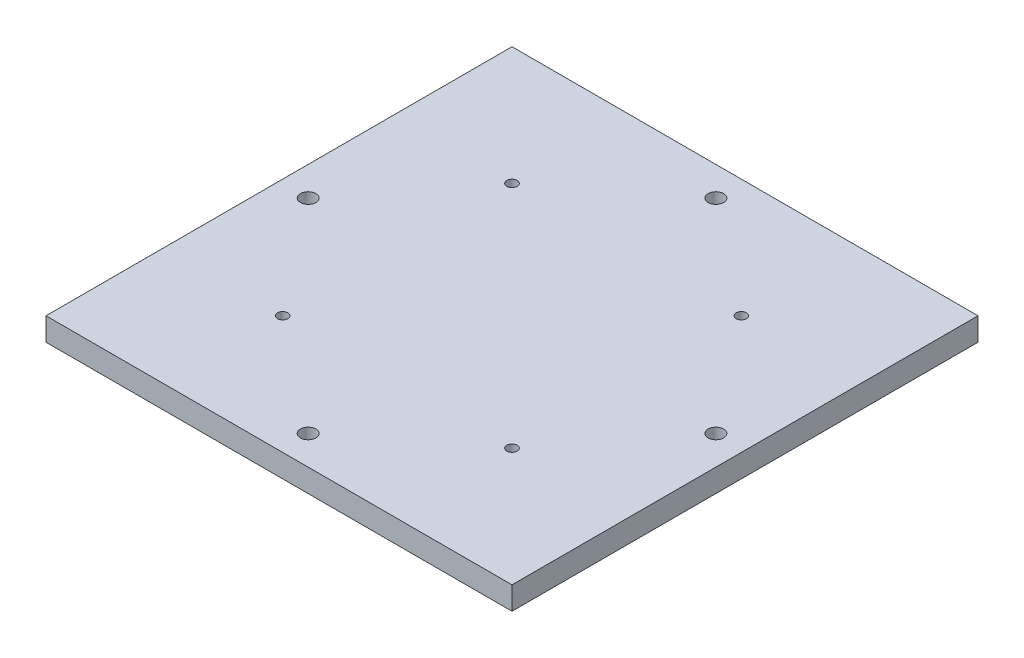
ISO-10303-21;
HEADER;
FILE_DESCRIPTION(('STEP AP214'),'2;1');
FILE_NAME('part.step','',(''),(''),'','','');
FILE_SCHEMA(('AUTOMOTIVE_DESIGN { 1 0 10303 214 1 1 1 1 }'));
ENDSEC;
DATA;
#1=APPLICATION_CONTEXT('core data for automotive mechanical design processes');
#2=APPLICATION_PROTOCOL_DEFINITION('international standard','automotive_design',2000,#1);
#3=PRODUCT_CONTEXT('',#1,'mechanical');
#4=PRODUCT('Part','Part','',(#3));
#5=PRODUCT_RELATED_PRODUCT_CATEGORY('part','',(#4));
#6=PRODUCT_DEFINITION_FORMATION('','',#4);
#7=PRODUCT_DEFINITION_CONTEXT('part definition',#1,'design');
#8=PRODUCT_DEFINITION('design','',#6,#7);
#9=PRODUCT_DEFINITION_SHAPE('','',#8);
#10=(LENGTH_UNIT() NAMED_UNIT(*) SI_UNIT(.MILLI.,.METRE.));
#11=(NAMED_UNIT(*) PLANE_ANGLE_UNIT() SI_UNIT($,.RADIAN.));
#12=(NAMED_UNIT(*) SI_UNIT($,.STERADIAN.) SOLID_ANGLE_UNIT());
#13=UNCERTAINTY_MEASURE_WITH_UNIT(LENGTH_MEASURE(1.E-05),#10,'distance_accuracy_value','');
#14=(GEOMETRIC_REPRESENTATION_CONTEXT(3) GLOBAL_UNCERTAINTY_ASSIGNED_CONTEXT((#13)) GLOBAL_UNIT_ASSIGNED_CONTEXT((#10,
#11,#12)) REPRESENTATION_CONTEXT('',''));
#15=CARTESIAN_POINT('',(0.,0.,0.));
#16=DIRECTION('',(0.,0.,1.));
#17=DIRECTION('',(1.,0.,0.));
#18=AXIS2_PLACEMENT_3D('',#15,#16,#17);
#19=CARTESIAN_POINT('',(0.,10.,0.));
#20=DIRECTION('',(0.,0.,-1.));
#21=DIRECTION('',(-1.,0.,0.));
#22=AXIS2_PLACEMENT_3D('',#19,#20,#21);
#23=PLANE('',#22);
#24=DIRECTION('',(1.,0.,0.));
#25=VECTOR('',#24,1.);
#26=CARTESIAN_POINT('',(0.,0.,0.));
#27=LINE('',#26,#25);
#28=CARTESIAN_POINT('',(0.,0.,0.));
#29=VERTEX_POINT('',#28);
#30=CARTESIAN_POINT('',(203.2,0.,0.));
#31=VERTEX_POINT('',#30);
#32=EDGE_CURVE('E132',#29,#31,#27,.T.);
#33=ORIENTED_EDGE('',*,*,#32,.T.);
#34=DIRECTION('',(0.,-1.,0.));
#35=VECTOR('',#34,1.);
#36=CARTESIAN_POINT('',(203.2,10.,0.));
#37=LINE('',#36,#35);
#38=CARTESIAN_POINT('',(203.2,10.,0.));
#39=VERTEX_POINT('',#38);
#40=EDGE_CURVE('E11',#39,#31,#37,.T.);
#41=ORIENTED_EDGE('',*,*,#40,.F.);
#42=DIRECTION('',(1.,0.,0.));
#43=VECTOR('',#42,1.);
#44=CARTESIAN_POINT('',(0.,10.,0.));
#45=LINE('',#44,#43);
#46=CARTESIAN_POINT('',(0.,10.,0.));
#47=VERTEX_POINT('',#46);
#48=EDGE_CURVE('E98',#47,#39,#45,.T.);
#49=ORIENTED_EDGE('',*,*,#48,.F.);
#50=DIRECTION('',(0.,-1.,0.));
#51=VECTOR('',#50,1.);
#52=CARTESIAN_POINT('',(0.,10.,0.));
#53=LINE('',#52,#51);
#54=EDGE_CURVE('E64',#47,#29,#53,.T.);
#55=ORIENTED_EDGE('',*,*,#54,.T.);
#56=EDGE_LOOP('',(#33,#41,#49,#55));
#57=FACE_BOUND('',#56,.T.);
#58=ADVANCED_FACE('F47',(#57),#23,.F.);
#59=CARTESIAN_POINT('',(203.2,10.,0.));
#60=DIRECTION('',(-1.,0.,0.));
#61=DIRECTION('',(0.,0.,1.));
#62=AXIS2_PLACEMENT_3D('',#59,#60,#61);
#63=PLANE('',#62);
#64=DIRECTION('',(0.,0.,-1.));
#65=VECTOR('',#64,1.);
#66=CARTESIAN_POINT('',(203.2,0.,0.));
#67=LINE('',#66,#65);
#68=CARTESIAN_POINT('',(203.2,0.,-203.2));
#69=VERTEX_POINT('',#68);
#70=EDGE_CURVE('E104',#31,#69,#67,.T.);
#71=ORIENTED_EDGE('',*,*,#70,.T.);
#72=DIRECTION('',(0.,-1.,0.));
#73=VECTOR('',#72,1.);
#74=CARTESIAN_POINT('',(203.2,10.,-203.2));
#75=LINE('',#74,#73);
#76=CARTESIAN_POINT('',(203.2,10.,-203.2));
#77=VERTEX_POINT('',#76);
#78=EDGE_CURVE('E56',#77,#69,#75,.T.);
#79=ORIENTED_EDGE('',*,*,#78,.F.);
#80=DIRECTION('',(0.,0.,-1.));
#81=VECTOR('',#80,1.);
#82=CARTESIAN_POINT('',(203.2,10.,0.));
#83=LINE('',#82,#81);
#84=EDGE_CURVE('E89',#39,#77,#83,.T.);
#85=ORIENTED_EDGE('',*,*,#84,.F.);
#86=ORIENTED_EDGE('',*,*,#40,.T.);
#87=EDGE_LOOP('',(#71,#79,#85,#86));
#88=FACE_BOUND('',#87,.T.);
#89=ADVANCED_FACE('F103',(#88),#63,.F.);
#90=CARTESIAN_POINT('',(0.,10.,-203.2));
#91=DIRECTION('',(0.,0.,-1.));
#92=DIRECTION('',(-1.,0.,0.));
#93=AXIS2_PLACEMENT_3D('',#90,#91,#92);
#94=PLANE('',#93);
#95=DIRECTION('',(1.,0.,0.));
#96=VECTOR('',#95,1.);
#97=CARTESIAN_POINT('',(0.,0.,-203.2));
#98=LINE('',#97,#96);
#99=CARTESIAN_POINT('',(0.,0.,-203.2));
#100=VERTEX_POINT('',#99);
#101=EDGE_CURVE('E138',#100,#69,#98,.T.);
#102=ORIENTED_EDGE('',*,*,#101,.F.);
#103=DIRECTION('',(0.,-1.,0.));
#104=VECTOR('',#103,1.);
#105=CARTESIAN_POINT('',(0.,10.,-203.2));
#106=LINE('',#105,#104);
#107=CARTESIAN_POINT('',(0.,10.,-203.2));
#108=VERTEX_POINT('',#107);
#109=EDGE_CURVE('E78',#108,#100,#106,.T.);
#110=ORIENTED_EDGE('',*,*,#109,.F.);
#111=DIRECTION('',(1.,0.,0.));
#112=VECTOR('',#111,1.);
#113=CARTESIAN_POINT('',(0.,10.,-203.2));
#114=LINE('',#113,#112);
#115=EDGE_CURVE('E97',#108,#77,#114,.T.);
#116=ORIENTED_EDGE('',*,*,#115,.T.);
#117=ORIENTED_EDGE('',*,*,#78,.T.);
#118=EDGE_LOOP('',(#102,#110,#116,#117));
#119=FACE_BOUND('',#118,.T.);
#120=ADVANCED_FACE('F108',(#119),#94,.T.);
#121=CARTESIAN_POINT('',(151.6,10.,-51.6));
#122=DIRECTION('',(0.,-1.,0.));
#123=DIRECTION('',(0.,0.,-1.));
#124=AXIS2_PLACEMENT_3D('',#121,#122,#123);
#125=CYLINDRICAL_SURFACE('',#124,2.25000000000001);
#126=CARTESIAN_POINT('',(151.6,10.,-51.6));
#127=DIRECTION('',(0.,1.,0.));
#128=DIRECTION('',(0.,0.,1.));
#129=AXIS2_PLACEMENT_3D('',#126,#127,#128);
#130=CIRCLE('',#129,2.25000000000001);
#131=CARTESIAN_POINT('',(151.6,10.,-49.35));
#132=VERTEX_POINT('',#131);
#133=EDGE_CURVE('E124',#132,#132,#130,.T.);
#134=ORIENTED_EDGE('',*,*,#133,.T.);
#135=EDGE_LOOP('',(#134));
#136=FACE_BOUND('',#135,.T.);
#137=CARTESIAN_POINT('',(151.6,0.,-51.6));
#138=DIRECTION('',(0.,1.,0.));
#139=DIRECTION('',(0.,0.,1.));
#140=AXIS2_PLACEMENT_3D('',#137,#138,#139);
#141=CIRCLE('',#140,2.25000000000001);
#142=CARTESIAN_POINT('',(151.6,0.,-49.35));
#143=VERTEX_POINT('',#142);
#144=EDGE_CURVE('E153',#143,#143,#141,.T.);
#145=ORIENTED_EDGE('',*,*,#144,.F.);
#146=EDGE_LOOP('',(#145));
#147=FACE_BOUND('',#146,.T.);
#148=ADVANCED_FACE('F255',(#136,#147),#125,.F.);
#149=CARTESIAN_POINT('',(151.6,10.,-151.6));
#150=DIRECTION('',(0.,-1.,0.));
#151=DIRECTION('',(0.,0.,-1.));
#152=AXIS2_PLACEMENT_3D('',#149,#150,#151);
#153=CYLINDRICAL_SURFACE('',#152,2.25000000000001);
#154=CARTESIAN_POINT('',(151.6,10.,-151.6));
#155=DIRECTION('',(0.,1.,0.));
#156=DIRECTION('',(0.,0.,1.));
#157=AXIS2_PLACEMENT_3D('',#154,#155,#156);
#158=CIRCLE('',#157,2.25000000000001);
#159=CARTESIAN_POINT('',(151.6,10.,-149.35));
#160=VERTEX_POINT('',#159);
#161=EDGE_CURVE('E120',#160,#160,#158,.T.);
#162=ORIENTED_EDGE('',*,*,#161,.T.);
#163=EDGE_LOOP('',(#162));
#164=FACE_BOUND('',#163,.T.);
#165=CARTESIAN_POINT('',(151.6,0.,-151.6));
#166=DIRECTION('',(0.,1.,0.));
#167=DIRECTION('',(0.,0.,1.));
#168=AXIS2_PLACEMENT_3D('',#165,#166,#167);
#169=CIRCLE('',#168,2.25000000000001);
#170=CARTESIAN_POINT('',(151.6,0.,-149.35));
#171=VERTEX_POINT('',#170);
#172=EDGE_CURVE('E149',#171,#171,#169,.T.);
#173=ORIENTED_EDGE('',*,*,#172,.F.);
#174=EDGE_LOOP('',(#173));
#175=FACE_BOUND('',#174,.T.);
#176=ADVANCED_FACE('F249',(#164,#175),#153,.F.);
#177=CARTESIAN_POINT('',(51.6,10.,-151.6));
#178=DIRECTION('',(0.,-1.,0.));
#179=DIRECTION('',(0.,0.,-1.));
#180=AXIS2_PLACEMENT_3D('',#177,#178,#179);
#181=CYLINDRICAL_SURFACE('',#180,2.25);
#182=CARTESIAN_POINT('',(51.6,10.,-151.6));
#183=DIRECTION('',(0.,1.,0.));
#184=DIRECTION('',(0.,0.,1.));
#185=AXIS2_PLACEMENT_3D('',#182,#183,#184);
#186=CIRCLE('',#185,2.25);
#187=CARTESIAN_POINT('',(51.6,10.,-149.35));
#188=VERTEX_POINT('',#187);
#189=EDGE_CURVE('E113',#188,#188,#186,.T.);
#190=ORIENTED_EDGE('',*,*,#189,.T.);
#191=EDGE_LOOP('',(#190));
#192=FACE_BOUND('',#191,.T.);
#193=CARTESIAN_POINT('',(51.6,0.,-151.6));
#194=DIRECTION('',(0.,1.,0.));
#195=DIRECTION('',(0.,0.,1.));
#196=AXIS2_PLACEMENT_3D('',#193,#194,#195);
#197=CIRCLE('',#196,2.25);
#198=CARTESIAN_POINT('',(51.6,0.,-149.35));
#199=VERTEX_POINT('',#198);
#200=EDGE_CURVE('E145',#199,#199,#197,.T.);
#201=ORIENTED_EDGE('',*,*,#200,.F.);
#202=EDGE_LOOP('',(#201));
#203=FACE_BOUND('',#202,.T.);
#204=ADVANCED_FACE('F241',(#192,#203),#181,.F.);
#205=CARTESIAN_POINT('',(0.,10.,0.));
#206=DIRECTION('',(-1.,0.,0.));
#207=DIRECTION('',(0.,0.,1.));
#208=AXIS2_PLACEMENT_3D('',#205,#206,#207);
#209=PLANE('',#208);
#210=DIRECTION('',(0.,0.,-1.));
#211=VECTOR('',#210,1.);
#212=CARTESIAN_POINT('',(0.,0.,0.));
#213=LINE('',#212,#211);
#214=EDGE_CURVE('E141',#29,#100,#213,.T.);
#215=ORIENTED_EDGE('',*,*,#214,.F.);
#216=ORIENTED_EDGE('',*,*,#54,.F.);
#217=DIRECTION('',(0.,0.,-1.));
#218=VECTOR('',#217,1.);
#219=CARTESIAN_POINT('',(0.,10.,0.));
#220=LINE('',#219,#218);
#221=EDGE_CURVE('E110',#47,#108,#220,.T.);
#222=ORIENTED_EDGE('',*,*,#221,.T.);
#223=ORIENTED_EDGE('',*,*,#109,.T.);
#224=EDGE_LOOP('',(#215,#216,#222,#223));
#225=FACE_BOUND('',#224,.T.);
#226=ADVANCED_FACE('F239',(#225),#209,.T.);
#227=CARTESIAN_POINT('',(51.6,10.,-51.6));
#228=DIRECTION('',(0.,-1.,0.));
#229=DIRECTION('',(0.,0.,-1.));
#230=AXIS2_PLACEMENT_3D('',#227,#228,#229);
#231=CYLINDRICAL_SURFACE('',#230,2.25);
#232=CARTESIAN_POINT('',(51.6,10.,-51.6));
#233=DIRECTION('',(0.,1.,0.));
#234=DIRECTION('',(0.,0.,1.));
#235=AXIS2_PLACEMENT_3D('',#232,#233,#234);
#236=CIRCLE('',#235,2.25);
#237=CARTESIAN_POINT('',(51.6,10.,-49.35));
#238=VERTEX_POINT('',#237);
#239=EDGE_CURVE('E128',#238,#238,#236,.T.);
#240=ORIENTED_EDGE('',*,*,#239,.T.);
#241=EDGE_LOOP('',(#240));
#242=FACE_BOUND('',#241,.T.);
#243=CARTESIAN_POINT('',(51.6,0.,-51.6));
#244=DIRECTION('',(0.,1.,0.));
#245=DIRECTION('',(0.,0.,1.));
#246=AXIS2_PLACEMENT_3D('',#243,#244,#245);
#247=CIRCLE('',#246,2.25);
#248=CARTESIAN_POINT('',(51.6,0.,-49.35));
#249=VERTEX_POINT('',#248);
#250=EDGE_CURVE('E157',#249,#249,#247,.T.);
#251=ORIENTED_EDGE('',*,*,#250,.F.);
#252=EDGE_LOOP('',(#251));
#253=FACE_BOUND('',#252,.T.);
#254=ADVANCED_FACE('F212',(#242,#253),#231,.F.);
#255=CARTESIAN_POINT('',(0.,10.,0.));
#256=DIRECTION('',(0.,1.,0.));
#257=DIRECTION('',(0.,0.,1.));
#258=AXIS2_PLACEMENT_3D('',#255,#256,#257);
#259=PLANE('',#258);
#260=CARTESIAN_POINT('',(101.6,10.,-12.7));
#261=DIRECTION('',(0.,1.,0.));
#262=DIRECTION('',(0.,0.,1.));
#263=AXIS2_PLACEMENT_3D('',#260,#261,#262);
#264=CIRCLE('',#263,3.37999999999999);
#265=CARTESIAN_POINT('',(101.6,10.,-9.32));
#266=VERTEX_POINT('',#265);
#267=EDGE_CURVE('E192',#266,#266,#264,.T.);
#268=ORIENTED_EDGE('',*,*,#267,.F.);
#269=EDGE_LOOP('',(#268));
#270=FACE_BOUND('',#269,.T.);
#271=CARTESIAN_POINT('',(12.7,10.,-101.6));
#272=DIRECTION('',(0.,1.,0.));
#273=DIRECTION('',(0.,0.,1.));
#274=AXIS2_PLACEMENT_3D('',#271,#272,#273);
#275=CIRCLE('',#274,3.38);
#276=CARTESIAN_POINT('',(12.7,10.,-98.22));
#277=VERTEX_POINT('',#276);
#278=EDGE_CURVE('E188',#277,#277,#275,.T.);
#279=ORIENTED_EDGE('',*,*,#278,.F.);
#280=EDGE_LOOP('',(#279));
#281=FACE_BOUND('',#280,.T.);
#282=CARTESIAN_POINT('',(101.6,10.,-190.5));
#283=DIRECTION('',(0.,1.,0.));
#284=DIRECTION('',(0.,0.,1.));
#285=AXIS2_PLACEMENT_3D('',#282,#283,#284);
#286=CIRCLE('',#285,3.38);
#287=CARTESIAN_POINT('',(101.6,10.,-187.12));
#288=VERTEX_POINT('',#287);
#289=EDGE_CURVE('E180',#288,#288,#286,.T.);
#290=ORIENTED_EDGE('',*,*,#289,.F.);
#291=EDGE_LOOP('',(#290));
#292=FACE_BOUND('',#291,.T.);
#293=CARTESIAN_POINT('',(190.5,10.,-101.6));
#294=DIRECTION('',(0.,1.,0.));
#295=DIRECTION('',(0.,0.,1.));
#296=AXIS2_PLACEMENT_3D('',#293,#294,#295);
#297=CIRCLE('',#296,3.38);
#298=CARTESIAN_POINT('',(190.5,10.,-98.22));
#299=VERTEX_POINT('',#298);
#300=EDGE_CURVE('E172',#299,#299,#297,.T.);
#301=ORIENTED_EDGE('',*,*,#300,.F.);
#302=EDGE_LOOP('',(#301));
#303=FACE_BOUND('',#302,.T.);
#304=ORIENTED_EDGE('',*,*,#48,.T.);
#305=ORIENTED_EDGE('',*,*,#84,.T.);
#306=ORIENTED_EDGE('',*,*,#115,.F.);
#307=ORIENTED_EDGE('',*,*,#221,.F.);
#308=EDGE_LOOP('',(#304,#305,#306,#307));
#309=FACE_BOUND('',#308,.T.);
#310=ORIENTED_EDGE('',*,*,#189,.F.);
#311=EDGE_LOOP('',(#310));
#312=FACE_BOUND('',#311,.T.);
#313=ORIENTED_EDGE('',*,*,#161,.F.);
#314=EDGE_LOOP('',(#313));
#315=FACE_BOUND('',#314,.T.);
#316=ORIENTED_EDGE('',*,*,#133,.F.);
#317=EDGE_LOOP('',(#316));
#318=FACE_BOUND('',#317,.T.);
#319=ORIENTED_EDGE('',*,*,#239,.F.);
#320=EDGE_LOOP('',(#319));
#321=FACE_BOUND('',#320,.T.);
#322=ADVANCED_FACE('F93',(#270,#281,#292,#303,#309,#312,#315,#318,#321),#259,.T.);
#323=CARTESIAN_POINT('',(0.,0.,0.));
#324=DIRECTION('',(0.,1.,0.));
#325=DIRECTION('',(0.,0.,1.));
#326=AXIS2_PLACEMENT_3D('',#323,#324,#325);
#327=PLANE('',#326);
#328=CARTESIAN_POINT('',(101.6,0.,-12.7));
#329=DIRECTION('',(0.,1.,0.));
#330=DIRECTION('',(0.,0.,1.));
#331=AXIS2_PLACEMENT_3D('',#328,#329,#330);
#332=CIRCLE('',#331,3.37999999999999);
#333=CARTESIAN_POINT('',(101.6,0.,-9.32));
#334=VERTEX_POINT('',#333);
#335=EDGE_CURVE('E135',#334,#334,#332,.T.);
#336=ORIENTED_EDGE('',*,*,#335,.T.);
#337=EDGE_LOOP('',(#336));
#338=FACE_BOUND('',#337,.T.);
#339=CARTESIAN_POINT('',(12.7,0.,-101.6));
#340=DIRECTION('',(0.,1.,0.));
#341=DIRECTION('',(0.,0.,1.));
#342=AXIS2_PLACEMENT_3D('',#339,#340,#341);
#343=CIRCLE('',#342,3.38);
#344=CARTESIAN_POINT('',(12.7,0.,-98.22));
#345=VERTEX_POINT('',#344);
#346=EDGE_CURVE('E184',#345,#345,#343,.T.);
#347=ORIENTED_EDGE('',*,*,#346,.T.);
#348=EDGE_LOOP('',(#347));
#349=FACE_BOUND('',#348,.T.);
#350=CARTESIAN_POINT('',(101.6,0.,-190.5));
#351=DIRECTION('',(0.,1.,0.));
#352=DIRECTION('',(0.,0.,1.));
#353=AXIS2_PLACEMENT_3D('',#350,#351,#352);
#354=CIRCLE('',#353,3.38);
#355=CARTESIAN_POINT('',(101.6,0.,-187.12));
#356=VERTEX_POINT('',#355);
#357=EDGE_CURVE('E176',#356,#356,#354,.T.);
#358=ORIENTED_EDGE('',*,*,#357,.T.);
#359=EDGE_LOOP('',(#358));
#360=FACE_BOUND('',#359,.T.);
#361=CARTESIAN_POINT('',(190.5,0.,-101.6));
#362=DIRECTION('',(0.,1.,0.));
#363=DIRECTION('',(0.,0.,1.));
#364=AXIS2_PLACEMENT_3D('',#361,#362,#363);
#365=CIRCLE('',#364,3.38);
#366=CARTESIAN_POINT('',(190.5,0.,-98.22));
#367=VERTEX_POINT('',#366);
#368=EDGE_CURVE('E168',#367,#367,#365,.T.);
#369=ORIENTED_EDGE('',*,*,#368,.T.);
#370=EDGE_LOOP('',(#369));
#371=FACE_BOUND('',#370,.T.);
#372=ORIENTED_EDGE('',*,*,#32,.F.);
#373=ORIENTED_EDGE('',*,*,#214,.T.);
#374=ORIENTED_EDGE('',*,*,#101,.T.);
#375=ORIENTED_EDGE('',*,*,#70,.F.);
#376=EDGE_LOOP('',(#372,#373,#374,#375));
#377=FACE_BOUND('',#376,.T.);
#378=ORIENTED_EDGE('',*,*,#200,.T.);
#379=EDGE_LOOP('',(#378));
#380=FACE_BOUND('',#379,.T.);
#381=ORIENTED_EDGE('',*,*,#172,.T.);
#382=EDGE_LOOP('',(#381));
#383=FACE_BOUND('',#382,.T.);
#384=ORIENTED_EDGE('',*,*,#144,.T.);
#385=EDGE_LOOP('',(#384));
#386=FACE_BOUND('',#385,.T.);
#387=ORIENTED_EDGE('',*,*,#250,.T.);
#388=EDGE_LOOP('',(#387));
#389=FACE_BOUND('',#388,.T.);
#390=ADVANCED_FACE('F200',(#338,#349,#360,#371,#377,#380,#383,#386,#389),#327,.F.);
#391=CARTESIAN_POINT('',(190.5,0.,-101.6));
#392=DIRECTION('',(0.,1.,0.));
#393=DIRECTION('',(0.,0.,1.));
#394=AXIS2_PLACEMENT_3D('',#391,#392,#393);
#395=CYLINDRICAL_SURFACE('',#394,3.38);
#396=ORIENTED_EDGE('',*,*,#368,.F.);
#397=EDGE_LOOP('',(#396));
#398=FACE_BOUND('',#397,.T.);
#399=ORIENTED_EDGE('',*,*,#300,.T.);
#400=EDGE_LOOP('',(#399));
#401=FACE_BOUND('',#400,.T.);
#402=ADVANCED_FACE('F220',(#398,#401),#395,.F.);
#403=CARTESIAN_POINT('',(101.6,0.,-190.5));
#404=DIRECTION('',(0.,1.,0.));
#405=DIRECTION('',(0.,0.,1.));
#406=AXIS2_PLACEMENT_3D('',#403,#404,#405);
#407=CYLINDRICAL_SURFACE('',#406,3.38);
#408=ORIENTED_EDGE('',*,*,#357,.F.);
#409=EDGE_LOOP('',(#408));
#410=FACE_BOUND('',#409,.T.);
#411=ORIENTED_EDGE('',*,*,#289,.T.);
#412=EDGE_LOOP('',(#411));
#413=FACE_BOUND('',#412,.T.);
#414=ADVANCED_FACE('F222',(#410,#413),#407,.F.);
#415=CARTESIAN_POINT('',(12.7,0.,-101.6));
#416=DIRECTION('',(0.,1.,0.));
#417=DIRECTION('',(0.,0.,1.));
#418=AXIS2_PLACEMENT_3D('',#415,#416,#417);
#419=CYLINDRICAL_SURFACE('',#418,3.38);
#420=ORIENTED_EDGE('',*,*,#346,.F.);
#421=EDGE_LOOP('',(#420));
#422=FACE_BOUND('',#421,.T.);
#423=ORIENTED_EDGE('',*,*,#278,.T.);
#424=EDGE_LOOP('',(#423));
#425=FACE_BOUND('',#424,.T.);
#426=ADVANCED_FACE('F206',(#422,#425),#419,.F.);
#427=CARTESIAN_POINT('',(101.6,0.,-12.7));
#428=DIRECTION('',(0.,1.,0.));
#429=DIRECTION('',(0.,0.,1.));
#430=AXIS2_PLACEMENT_3D('',#427,#428,#429);
#431=CYLINDRICAL_SURFACE('',#430,3.37999999999999);
#432=ORIENTED_EDGE('',*,*,#335,.F.);
#433=EDGE_LOOP('',(#432));
#434=FACE_BOUND('',#433,.T.);
#435=ORIENTED_EDGE('',*,*,#267,.T.);
#436=EDGE_LOOP('',(#435));
#437=FACE_BOUND('',#436,.T.);
#438=ADVANCED_FACE('F203',(#434,#437),#431,.F.);
#439=CLOSED_SHELL('',(#58,#89,#120,#148,#176,#204,#226,#254,#322,#390,#402,#414,#426,#438));
#440=MANIFOLD_SOLID_BREP('B2',#439);
#441=ADVANCED_BREP_SHAPE_REPRESENTATION('',(#18,#440),#14);
#442=SHAPE_DEFINITION_REPRESENTATION(#9,#441);
ENDSEC;
END-ISO-10303-21;
